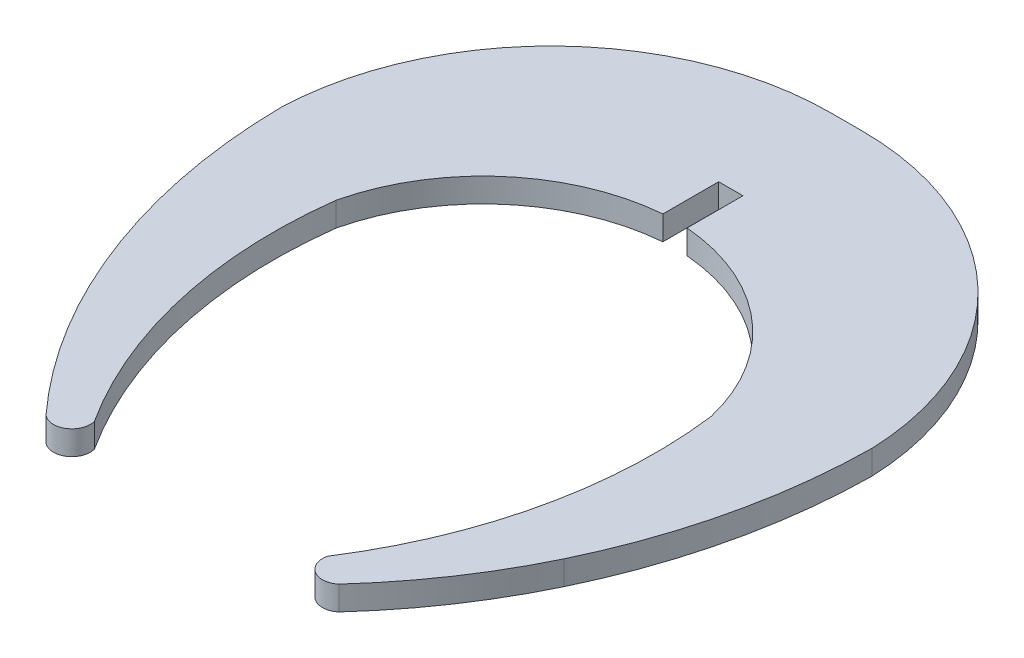
ISO-10303-21;
HEADER;
FILE_DESCRIPTION(('STEP AP214'),'2;1');
FILE_NAME('part.step','',(''),(''),'','','');
FILE_SCHEMA(('AUTOMOTIVE_DESIGN { 1 0 10303 214 1 1 1 1 }'));
ENDSEC;
DATA;
#1=APPLICATION_CONTEXT('core data for automotive mechanical design processes');
#2=APPLICATION_PROTOCOL_DEFINITION('international standard','automotive_design',2000,#1);
#3=PRODUCT_CONTEXT('',#1,'mechanical');
#4=PRODUCT('Part','Part','',(#3));
#5=PRODUCT_RELATED_PRODUCT_CATEGORY('part','',(#4));
#6=PRODUCT_DEFINITION_FORMATION('','',#4);
#7=PRODUCT_DEFINITION_CONTEXT('part definition',#1,'design');
#8=PRODUCT_DEFINITION('design','',#6,#7);
#9=PRODUCT_DEFINITION_SHAPE('','',#8);
#10=(LENGTH_UNIT() NAMED_UNIT(*) SI_UNIT(.MILLI.,.METRE.));
#11=(NAMED_UNIT(*) PLANE_ANGLE_UNIT() SI_UNIT($,.RADIAN.));
#12=(NAMED_UNIT(*) SI_UNIT($,.STERADIAN.) SOLID_ANGLE_UNIT());
#13=UNCERTAINTY_MEASURE_WITH_UNIT(LENGTH_MEASURE(1.E-05),#10,'distance_accuracy_value','');
#14=(GEOMETRIC_REPRESENTATION_CONTEXT(3) GLOBAL_UNCERTAINTY_ASSIGNED_CONTEXT((#13)) GLOBAL_UNIT_ASSIGNED_CONTEXT((#10,
#11,#12)) REPRESENTATION_CONTEXT('',''));
#15=CARTESIAN_POINT('',(0.,0.,0.));
#16=DIRECTION('',(0.,0.,1.));
#17=DIRECTION('',(1.,0.,0.));
#18=AXIS2_PLACEMENT_3D('',#15,#16,#17);
#19=CARTESIAN_POINT('',(164.81900314015,1.45,-291.24130125598));
#20=DIRECTION('',(0.,-1.,0.));
#21=DIRECTION('',(0.,0.,-1.));
#22=AXIS2_PLACEMENT_3D('',#19,#20,#21);
#23=CYLINDRICAL_SURFACE('',#22,28.125270990971);
#24=CARTESIAN_POINT('',(164.81900314015,0.,-291.24130125598));
#25=DIRECTION('',(0.,1.,0.));
#26=DIRECTION('',(0.,0.,1.));
#27=AXIS2_PLACEMENT_3D('',#24,#25,#26);
#28=CIRCLE('',#27,28.125270990971);
#29=CARTESIAN_POINT('',(188.476639673771,0.,-276.031202572584));
#30=VERTEX_POINT('',#29);
#31=CARTESIAN_POINT('',(192.718667057805,0.,-294.796525805493));
#32=VERTEX_POINT('',#31);
#33=EDGE_CURVE('E180',#30,#32,#28,.T.);
#34=ORIENTED_EDGE('',*,*,#33,.F.);
#35=DIRECTION('',(0.,-1.,0.));
#36=VECTOR('',#35,1.);
#37=CARTESIAN_POINT('',(188.476639673771,1.45,-276.031202572584));
#38=LINE('',#37,#36);
#39=CARTESIAN_POINT('',(188.476639673771,1.45,-276.031202572584));
#40=VERTEX_POINT('',#39);
#41=EDGE_CURVE('E11',#40,#30,#38,.T.);
#42=ORIENTED_EDGE('',*,*,#41,.F.);
#43=CARTESIAN_POINT('',(164.81900314015,1.45,-291.24130125598));
#44=DIRECTION('',(0.,1.,0.));
#45=DIRECTION('',(0.,0.,1.));
#46=AXIS2_PLACEMENT_3D('',#43,#44,#45);
#47=CIRCLE('',#46,28.125270990971);
#48=CARTESIAN_POINT('',(192.718667057805,1.45,-294.796525805493));
#49=VERTEX_POINT('',#48);
#50=EDGE_CURVE('E217',#40,#49,#47,.T.);
#51=ORIENTED_EDGE('',*,*,#50,.T.);
#52=DIRECTION('',(0.,-1.,0.));
#53=VECTOR('',#52,1.);
#54=CARTESIAN_POINT('',(192.718667057805,1.45,-294.796525805493));
#55=LINE('',#54,#53);
#56=EDGE_CURVE('E53',#49,#32,#55,.T.);
#57=ORIENTED_EDGE('',*,*,#56,.T.);
#58=EDGE_LOOP('',(#34,#42,#51,#57));
#59=FACE_BOUND('',#58,.T.);
#60=ADVANCED_FACE('F37',(#59),#23,.F.);
#61=CARTESIAN_POINT('',(189.540988425837,1.45,-275.743940180891));
#62=DIRECTION('',(0.,-1.,0.));
#63=DIRECTION('',(0.,0.,-1.));
#64=AXIS2_PLACEMENT_3D('',#61,#62,#63);
#65=CYLINDRICAL_SURFACE('',#64,1.10243274067267);
#66=CARTESIAN_POINT('',(189.540988425837,0.,-275.743940180891));
#67=DIRECTION('',(0.,1.,0.));
#68=DIRECTION('',(0.,0.,1.));
#69=AXIS2_PLACEMENT_3D('',#66,#67,#68);
#70=CIRCLE('',#69,1.10243274067267);
#71=CARTESIAN_POINT('',(190.262797367854,0.,-274.9106636368));
#72=VERTEX_POINT('',#71);
#73=EDGE_CURVE('E182',#30,#72,#70,.T.);
#74=ORIENTED_EDGE('',*,*,#73,.T.);
#75=DIRECTION('',(0.,-1.,0.));
#76=VECTOR('',#75,1.);
#77=CARTESIAN_POINT('',(190.262797367854,1.45,-274.9106636368));
#78=LINE('',#77,#76);
#79=CARTESIAN_POINT('',(190.262797367854,1.45,-274.9106636368));
#80=VERTEX_POINT('',#79);
#81=EDGE_CURVE('E45',#80,#72,#78,.T.);
#82=ORIENTED_EDGE('',*,*,#81,.F.);
#83=CARTESIAN_POINT('',(189.540988425837,1.45,-275.743940180891));
#84=DIRECTION('',(0.,1.,0.));
#85=DIRECTION('',(0.,0.,1.));
#86=AXIS2_PLACEMENT_3D('',#83,#84,#85);
#87=CIRCLE('',#86,1.10243274067267);
#88=EDGE_CURVE('E467',#40,#80,#87,.T.);
#89=ORIENTED_EDGE('',*,*,#88,.F.);
#90=ORIENTED_EDGE('',*,*,#41,.T.);
#91=EDGE_LOOP('',(#74,#82,#89,#90));
#92=FACE_BOUND('',#91,.T.);
#93=ADVANCED_FACE('F312',(#92),#65,.T.);
#94=CARTESIAN_POINT('',(165.404822420396,1.45,-297.533530419202));
#95=DIRECTION('',(0.,-1.,0.));
#96=DIRECTION('',(0.,0.,-1.));
#97=AXIS2_PLACEMENT_3D('',#94,#95,#96);
#98=CYLINDRICAL_SURFACE('',#97,33.611203785981);
#99=CARTESIAN_POINT('',(165.404822420396,0.,-297.533530419202));
#100=DIRECTION('',(0.,1.,0.));
#101=DIRECTION('',(0.,0.,1.));
#102=AXIS2_PLACEMENT_3D('',#99,#100,#101);
#103=CIRCLE('',#102,33.611203785981);
#104=CARTESIAN_POINT('',(195.707854724813,0.,-282.992579518376));
#105=VERTEX_POINT('',#104);
#106=EDGE_CURVE('E184',#72,#105,#103,.T.);
#107=ORIENTED_EDGE('',*,*,#106,.T.);
#108=DIRECTION('',(0.,-1.,0.));
#109=VECTOR('',#108,1.);
#110=CARTESIAN_POINT('',(195.707854724813,1.45,-282.992579518376));
#111=LINE('',#110,#109);
#112=CARTESIAN_POINT('',(195.707854724813,1.45,-282.992579518376));
#113=VERTEX_POINT('',#112);
#114=EDGE_CURVE('E243',#113,#105,#111,.T.);
#115=ORIENTED_EDGE('',*,*,#114,.F.);
#116=CARTESIAN_POINT('',(165.404822420396,1.45,-297.533530419202));
#117=DIRECTION('',(0.,1.,0.));
#118=DIRECTION('',(0.,0.,1.));
#119=AXIS2_PLACEMENT_3D('',#116,#117,#118);
#120=CIRCLE('',#119,33.611203785981);
#121=EDGE_CURVE('E252',#80,#113,#120,.T.);
#122=ORIENTED_EDGE('',*,*,#121,.F.);
#123=ORIENTED_EDGE('',*,*,#81,.T.);
#124=EDGE_LOOP('',(#107,#115,#122,#123));
#125=FACE_BOUND('',#124,.T.);
#126=ADVANCED_FACE('F250',(#125),#98,.T.);
#127=CARTESIAN_POINT('',(163.664056085918,1.45,-298.368839395134));
#128=DIRECTION('',(0.,-1.,0.));
#129=DIRECTION('',(0.,0.,-1.));
#130=AXIS2_PLACEMENT_3D('',#127,#128,#129);
#131=CYLINDRICAL_SURFACE('',#130,35.5420089332);
#132=CARTESIAN_POINT('',(163.664056085918,0.,-298.368839395134));
#133=DIRECTION('',(0.,1.,0.));
#134=DIRECTION('',(0.,0.,1.));
#135=AXIS2_PLACEMENT_3D('',#132,#133,#134);
#136=CIRCLE('',#135,35.5420089332);
#137=CARTESIAN_POINT('',(199.203888548825,0.,-297.975510631665));
#138=VERTEX_POINT('',#137);
#139=EDGE_CURVE('E186',#105,#138,#136,.T.);
#140=ORIENTED_EDGE('',*,*,#139,.T.);
#141=DIRECTION('',(0.,-1.,0.));
#142=VECTOR('',#141,1.);
#143=CARTESIAN_POINT('',(199.203888548825,1.45,-297.975510631665));
#144=LINE('',#143,#142);
#145=CARTESIAN_POINT('',(199.203888548825,1.45,-297.975510631665));
#146=VERTEX_POINT('',#145);
#147=EDGE_CURVE('E240',#146,#138,#144,.T.);
#148=ORIENTED_EDGE('',*,*,#147,.F.);
#149=CARTESIAN_POINT('',(163.664056085918,1.45,-298.368839395134));
#150=DIRECTION('',(0.,1.,0.));
#151=DIRECTION('',(0.,0.,1.));
#152=AXIS2_PLACEMENT_3D('',#149,#150,#151);
#153=CIRCLE('',#152,35.5420089332);
#154=EDGE_CURVE('E271',#113,#146,#153,.T.);
#155=ORIENTED_EDGE('',*,*,#154,.F.);
#156=ORIENTED_EDGE('',*,*,#114,.T.);
#157=EDGE_LOOP('',(#140,#148,#155,#156));
#158=FACE_BOUND('',#157,.T.);
#159=ADVANCED_FACE('F261',(#158),#131,.T.);
#160=CARTESIAN_POINT('',(182.396440485219,1.45,-297.37433335078));
#161=DIRECTION('',(0.,-1.,0.));
#162=DIRECTION('',(0.,0.,-1.));
#163=AXIS2_PLACEMENT_3D('',#160,#161,#162);
#164=CYLINDRICAL_SURFACE('',#163,16.818196233064);
#165=CARTESIAN_POINT('',(182.396440485219,0.,-297.37433335078));
#166=DIRECTION('',(0.,1.,0.));
#167=DIRECTION('',(0.,0.,1.));
#168=AXIS2_PLACEMENT_3D('',#165,#166,#167);
#169=CIRCLE('',#168,16.818196233064);
#170=CARTESIAN_POINT('',(182.39644062977,0.,-314.192529583844));
#171=VERTEX_POINT('',#170);
#172=EDGE_CURVE('E188',#138,#171,#169,.T.);
#173=ORIENTED_EDGE('',*,*,#172,.T.);
#174=DIRECTION('',(0.,-1.,0.));
#175=VECTOR('',#174,1.);
#176=CARTESIAN_POINT('',(182.39644062977,1.45,-314.192529583844));
#177=LINE('',#176,#175);
#178=CARTESIAN_POINT('',(182.39644062977,1.45,-314.192529583844));
#179=VERTEX_POINT('',#178);
#180=EDGE_CURVE('E238',#179,#171,#177,.T.);
#181=ORIENTED_EDGE('',*,*,#180,.F.);
#182=CARTESIAN_POINT('',(182.396440485219,1.45,-297.37433335078));
#183=DIRECTION('',(0.,1.,0.));
#184=DIRECTION('',(0.,0.,1.));
#185=AXIS2_PLACEMENT_3D('',#182,#183,#184);
#186=CIRCLE('',#185,16.818196233064);
#187=EDGE_CURVE('E267',#146,#179,#186,.T.);
#188=ORIENTED_EDGE('',*,*,#187,.F.);
#189=ORIENTED_EDGE('',*,*,#147,.T.);
#190=EDGE_LOOP('',(#173,#181,#188,#189));
#191=FACE_BOUND('',#190,.T.);
#192=ADVANCED_FACE('F265',(#191),#164,.T.);
#193=CARTESIAN_POINT('',(-48.3605533165496,1.45,-314.192559632692));
#194=DIRECTION('',(1.30218581236673E-07,0.,-0.999999999999991));
#195=DIRECTION('',(-0.999999999999992,0.,-1.30218581236673E-07));
#196=AXIS2_PLACEMENT_3D('',#193,#194,#195);
#197=PLANE('',#196);
#198=DIRECTION('',(0.999999999999992,0.,1.30218581236673E-07));
#199=VECTOR('',#198,1.);
#200=CARTESIAN_POINT('',(-48.3605533165496,0.,-314.192559632692));
#201=LINE('',#200,#199);
#202=CARTESIAN_POINT('',(180.53034742943,0.,-314.192529826844));
#203=VERTEX_POINT('',#202);
#204=EDGE_CURVE('E191',#203,#171,#201,.T.);
#205=ORIENTED_EDGE('',*,*,#204,.F.);
#206=DIRECTION('',(0.,-1.,0.));
#207=VECTOR('',#206,1.);
#208=CARTESIAN_POINT('',(180.53034742943,1.45,-314.192529826844));
#209=LINE('',#208,#207);
#210=CARTESIAN_POINT('',(180.53034742943,1.45,-314.192529826844));
#211=VERTEX_POINT('',#210);
#212=EDGE_CURVE('E236',#211,#203,#209,.T.);
#213=ORIENTED_EDGE('',*,*,#212,.F.);
#214=DIRECTION('',(0.999999999999992,0.,1.30218581236673E-07));
#215=VECTOR('',#214,1.);
#216=CARTESIAN_POINT('',(-48.3605533165496,1.45,-314.192559632692));
#217=LINE('',#216,#215);
#218=EDGE_CURVE('E270',#211,#179,#217,.T.);
#219=ORIENTED_EDGE('',*,*,#218,.T.);
#220=ORIENTED_EDGE('',*,*,#180,.T.);
#221=EDGE_LOOP('',(#205,#213,#219,#220));
#222=FACE_BOUND('',#221,.T.);
#223=ADVANCED_FACE('F411',(#222),#197,.T.);
#224=CARTESIAN_POINT('',(180.53034742943,1.45,-297.37433335078));
#225=DIRECTION('',(0.,-1.,0.));
#226=DIRECTION('',(0.,0.,-1.));
#227=AXIS2_PLACEMENT_3D('',#224,#225,#226);
#228=CYLINDRICAL_SURFACE('',#227,16.818196476064);
#229=CARTESIAN_POINT('',(180.53034742943,0.,-297.37433335078));
#230=DIRECTION('',(0.,1.,0.));
#231=DIRECTION('',(0.,0.,1.));
#232=AXIS2_PLACEMENT_3D('',#229,#230,#231);
#233=CIRCLE('',#232,16.818196476064);
#234=CARTESIAN_POINT('',(163.722899070199,0.,-297.975509164713));
#235=VERTEX_POINT('',#234);
#236=EDGE_CURVE('E194',#203,#235,#233,.T.);
#237=ORIENTED_EDGE('',*,*,#236,.T.);
#238=DIRECTION('',(0.,-1.,0.));
#239=VECTOR('',#238,1.);
#240=CARTESIAN_POINT('',(163.722899070199,1.45,-297.975509164713));
#241=LINE('',#240,#239);
#242=CARTESIAN_POINT('',(163.722899070199,1.45,-297.975509164713));
#243=VERTEX_POINT('',#242);
#244=EDGE_CURVE('E233',#243,#235,#241,.T.);
#245=ORIENTED_EDGE('',*,*,#244,.F.);
#246=CARTESIAN_POINT('',(180.53034742943,1.45,-297.37433335078));
#247=DIRECTION('',(0.,1.,0.));
#248=DIRECTION('',(0.,0.,1.));
#249=AXIS2_PLACEMENT_3D('',#246,#247,#248);
#250=CIRCLE('',#249,16.818196476064);
#251=EDGE_CURVE('E273',#211,#243,#250,.T.);
#252=ORIENTED_EDGE('',*,*,#251,.F.);
#253=ORIENTED_EDGE('',*,*,#212,.T.);
#254=EDGE_LOOP('',(#237,#245,#252,#253));
#255=FACE_BOUND('',#254,.T.);
#256=ADVANCED_FACE('F401',(#255),#228,.T.);
#257=CARTESIAN_POINT('',(199.26273198907,1.45,-298.368840644731));
#258=DIRECTION('',(0.,-1.,0.));
#259=DIRECTION('',(0.,0.,-1.));
#260=AXIS2_PLACEMENT_3D('',#257,#258,#259);
#261=CYLINDRICAL_SURFACE('',#260,35.5420094192);
#262=CARTESIAN_POINT('',(199.26273198907,0.,-298.368840644731));
#263=DIRECTION('',(0.,1.,0.));
#264=DIRECTION('',(0.,0.,1.));
#265=AXIS2_PLACEMENT_3D('',#262,#263,#264);
#266=CIRCLE('',#265,35.5420094192);
#267=CARTESIAN_POINT('',(167.21893204676,0.,-282.99258236088));
#268=VERTEX_POINT('',#267);
#269=EDGE_CURVE('E196',#235,#268,#266,.T.);
#270=ORIENTED_EDGE('',*,*,#269,.T.);
#271=DIRECTION('',(0.,-1.,0.));
#272=VECTOR('',#271,1.);
#273=CARTESIAN_POINT('',(167.21893204676,1.45,-282.99258236088));
#274=LINE('',#273,#272);
#275=CARTESIAN_POINT('',(167.21893204676,1.45,-282.99258236088));
#276=VERTEX_POINT('',#275);
#277=EDGE_CURVE('E230',#276,#268,#274,.T.);
#278=ORIENTED_EDGE('',*,*,#277,.F.);
#279=CARTESIAN_POINT('',(199.26273198907,1.45,-298.368840644731));
#280=DIRECTION('',(0.,1.,0.));
#281=DIRECTION('',(0.,0.,1.));
#282=AXIS2_PLACEMENT_3D('',#279,#280,#281);
#283=CIRCLE('',#282,35.5420094192);
#284=EDGE_CURVE('E279',#243,#276,#283,.T.);
#285=ORIENTED_EDGE('',*,*,#284,.F.);
#286=ORIENTED_EDGE('',*,*,#244,.T.);
#287=EDGE_LOOP('',(#270,#278,#285,#286));
#288=FACE_BOUND('',#287,.T.);
#289=ADVANCED_FACE('F391',(#288),#261,.T.);
#290=CARTESIAN_POINT('',(197.52196502154,1.45,-297.533531302992));
#291=DIRECTION('',(0.,-1.,0.));
#292=DIRECTION('',(0.,0.,-1.));
#293=AXIS2_PLACEMENT_3D('',#290,#291,#292);
#294=CYLINDRICAL_SURFACE('',#293,33.611203542981);
#295=CARTESIAN_POINT('',(197.52196502154,0.,-297.533531302992));
#296=DIRECTION('',(0.,1.,0.));
#297=DIRECTION('',(0.,0.,1.));
#298=AXIS2_PLACEMENT_3D('',#295,#296,#297);
#299=CIRCLE('',#298,33.611203542981);
#300=CARTESIAN_POINT('',(172.663989446777,0.,-274.910665570902));
#301=VERTEX_POINT('',#300);
#302=EDGE_CURVE('E198',#268,#301,#299,.T.);
#303=ORIENTED_EDGE('',*,*,#302,.T.);
#304=DIRECTION('',(0.,-1.,0.));
#305=VECTOR('',#304,1.);
#306=CARTESIAN_POINT('',(172.663989446777,1.45,-274.910665570902));
#307=LINE('',#306,#305);
#308=CARTESIAN_POINT('',(172.663989446777,1.45,-274.910665570902));
#309=VERTEX_POINT('',#308);
#310=EDGE_CURVE('E227',#309,#301,#307,.T.);
#311=ORIENTED_EDGE('',*,*,#310,.F.);
#312=CARTESIAN_POINT('',(197.52196502154,1.45,-297.533531302992));
#313=DIRECTION('',(0.,1.,0.));
#314=DIRECTION('',(0.,0.,1.));
#315=AXIS2_PLACEMENT_3D('',#312,#313,#314);
#316=CIRCLE('',#315,33.611203542981);
#317=EDGE_CURVE('E281',#276,#309,#316,.T.);
#318=ORIENTED_EDGE('',*,*,#317,.F.);
#319=ORIENTED_EDGE('',*,*,#277,.T.);
#320=EDGE_LOOP('',(#303,#311,#318,#319));
#321=FACE_BOUND('',#320,.T.);
#322=ADVANCED_FACE('F381',(#321),#294,.T.);
#323=CARTESIAN_POINT('',(173.385799627681,1.45,-275.743941463555));
#324=DIRECTION('',(0.,-1.,0.));
#325=DIRECTION('',(0.,0.,-1.));
#326=AXIS2_PLACEMENT_3D('',#323,#324,#325);
#327=CYLINDRICAL_SURFACE('',#326,1.10243305943426);
#328=CARTESIAN_POINT('',(173.385799627681,0.,-275.743941463555));
#329=DIRECTION('',(0.,1.,0.));
#330=DIRECTION('',(0.,0.,1.));
#331=AXIS2_PLACEMENT_3D('',#328,#329,#330);
#332=CIRCLE('',#331,1.10243305943426);
#333=CARTESIAN_POINT('',(174.450149538204,0.,-276.031200786297));
#334=VERTEX_POINT('',#333);
#335=EDGE_CURVE('E200',#301,#334,#332,.T.);
#336=ORIENTED_EDGE('',*,*,#335,.T.);
#337=DIRECTION('',(0.,-1.,0.));
#338=VECTOR('',#337,1.);
#339=CARTESIAN_POINT('',(174.450149538204,1.45,-276.031200786297));
#340=LINE('',#339,#338);
#341=CARTESIAN_POINT('',(174.450149538204,1.45,-276.031200786297));
#342=VERTEX_POINT('',#341);
#343=EDGE_CURVE('E225',#342,#334,#340,.T.);
#344=ORIENTED_EDGE('',*,*,#343,.F.);
#345=CARTESIAN_POINT('',(173.385799627681,1.45,-275.743941463555));
#346=DIRECTION('',(0.,1.,0.));
#347=DIRECTION('',(0.,0.,1.));
#348=AXIS2_PLACEMENT_3D('',#345,#346,#347);
#349=CIRCLE('',#348,1.10243305943426);
#350=EDGE_CURVE('E283',#309,#342,#349,.T.);
#351=ORIENTED_EDGE('',*,*,#350,.F.);
#352=ORIENTED_EDGE('',*,*,#310,.T.);
#353=EDGE_LOOP('',(#336,#344,#351,#352));
#354=FACE_BOUND('',#353,.T.);
#355=ADVANCED_FACE('F372',(#354),#327,.T.);
#356=CARTESIAN_POINT('',(198.107784746218,1.45,-291.241301531529));
#357=DIRECTION('',(0.,-1.,0.));
#358=DIRECTION('',(0.,0.,-1.));
#359=AXIS2_PLACEMENT_3D('',#356,#357,#358);
#360=CYLINDRICAL_SURFACE('',#359,28.125270990971);
#361=CARTESIAN_POINT('',(198.107784746218,0.,-291.241301531529));
#362=DIRECTION('',(0.,1.,0.));
#363=DIRECTION('',(0.,0.,1.));
#364=AXIS2_PLACEMENT_3D('',#361,#362,#363);
#365=CIRCLE('',#364,28.125270990971);
#366=CARTESIAN_POINT('',(170.208120698498,0.,-294.796525060358));
#367=VERTEX_POINT('',#366);
#368=EDGE_CURVE('E203',#367,#334,#365,.T.);
#369=ORIENTED_EDGE('',*,*,#368,.F.);
#370=DIRECTION('',(0.,-1.,0.));
#371=VECTOR('',#370,1.);
#372=CARTESIAN_POINT('',(170.208120698498,1.45,-294.796525060358));
#373=LINE('',#372,#371);
#374=CARTESIAN_POINT('',(170.208120698498,1.45,-294.796525060358));
#375=VERTEX_POINT('',#374);
#376=EDGE_CURVE('E223',#375,#367,#373,.T.);
#377=ORIENTED_EDGE('',*,*,#376,.F.);
#378=CARTESIAN_POINT('',(198.107784746218,1.45,-291.241301531529));
#379=DIRECTION('',(0.,1.,0.));
#380=DIRECTION('',(0.,0.,1.));
#381=AXIS2_PLACEMENT_3D('',#378,#379,#380);
#382=CIRCLE('',#381,28.125270990971);
#383=EDGE_CURVE('E285',#375,#342,#382,.T.);
#384=ORIENTED_EDGE('',*,*,#383,.T.);
#385=ORIENTED_EDGE('',*,*,#343,.T.);
#386=EDGE_LOOP('',(#369,#377,#384,#385));
#387=FACE_BOUND('',#386,.T.);
#388=ADVANCED_FACE('F298',(#387),#360,.F.);
#389=CARTESIAN_POINT('',(181.739920034534,1.45,-292.084685769131));
#390=DIRECTION('',(0.,-1.,0.));
#391=DIRECTION('',(0.,0.,-1.));
#392=AXIS2_PLACEMENT_3D('',#389,#390,#391);
#393=CYLINDRICAL_SURFACE('',#392,11.846369412948);
#394=CARTESIAN_POINT('',(181.739920034534,0.,-292.084685769131));
#395=DIRECTION('',(0.,1.,0.));
#396=DIRECTION('',(0.,0.,1.));
#397=AXIS2_PLACEMENT_3D('',#394,#395,#396);
#398=CIRCLE('',#397,11.846369412948);
#399=CARTESIAN_POINT('',(180.734392460618,0.,-303.888303120017));
#400=VERTEX_POINT('',#399);
#401=EDGE_CURVE('E206',#400,#367,#398,.T.);
#402=ORIENTED_EDGE('',*,*,#401,.F.);
#403=DIRECTION('',(0.,-1.,0.));
#404=VECTOR('',#403,1.);
#405=CARTESIAN_POINT('',(180.734392460618,1.45,-303.888303120017));
#406=LINE('',#405,#404);
#407=CARTESIAN_POINT('',(180.734392460618,1.45,-303.888303120017));
#408=VERTEX_POINT('',#407);
#409=EDGE_CURVE('E221',#408,#400,#406,.T.);
#410=ORIENTED_EDGE('',*,*,#409,.F.);
#411=CARTESIAN_POINT('',(181.739920034534,1.45,-292.084685769131));
#412=DIRECTION('',(0.,1.,0.));
#413=DIRECTION('',(0.,0.,1.));
#414=AXIS2_PLACEMENT_3D('',#411,#412,#413);
#415=CIRCLE('',#414,11.846369412948);
#416=EDGE_CURVE('E288',#408,#375,#415,.T.);
#417=ORIENTED_EDGE('',*,*,#416,.T.);
#418=ORIENTED_EDGE('',*,*,#376,.T.);
#419=EDGE_LOOP('',(#402,#410,#417,#418));
#420=FACE_BOUND('',#419,.T.);
#421=ADVANCED_FACE('F292',(#420),#393,.F.);
#422=CARTESIAN_POINT('',(180.734385045591,1.45,-266.906624786154));
#423=DIRECTION('',(-0.99999999999998,0.,-2.00505425756201E-07));
#424=DIRECTION('',(-2.00505425756201E-07,0.,0.99999999999998));
#425=AXIS2_PLACEMENT_3D('',#422,#423,#424);
#426=PLANE('',#425);
#427=DIRECTION('',(2.00505425756201E-07,0.,-0.99999999999998));
#428=VECTOR('',#427,1.);
#429=CARTESIAN_POINT('',(180.734385045591,0.,-266.906624786154));
#430=LINE('',#429,#428);
#431=CARTESIAN_POINT('',(180.734393132994,0.,-307.241707050971));
#432=VERTEX_POINT('',#431);
#433=EDGE_CURVE('E209',#400,#432,#430,.T.);
#434=ORIENTED_EDGE('',*,*,#433,.T.);
#435=DIRECTION('',(0.,-1.,0.));
#436=VECTOR('',#435,1.);
#437=CARTESIAN_POINT('',(180.734393132994,1.45,-307.241707050971));
#438=LINE('',#437,#436);
#439=CARTESIAN_POINT('',(180.734393132994,1.45,-307.241707050971));
#440=VERTEX_POINT('',#439);
#441=EDGE_CURVE('E172',#440,#432,#438,.T.);
#442=ORIENTED_EDGE('',*,*,#441,.F.);
#443=DIRECTION('',(2.00505425756201E-07,0.,-0.99999999999998));
#444=VECTOR('',#443,1.);
#445=CARTESIAN_POINT('',(180.734385045591,1.45,-266.906624786154));
#446=LINE('',#445,#444);
#447=EDGE_CURVE('E160',#408,#440,#446,.T.);
#448=ORIENTED_EDGE('',*,*,#447,.F.);
#449=ORIENTED_EDGE('',*,*,#409,.T.);
#450=EDGE_LOOP('',(#434,#442,#448,#449));
#451=FACE_BOUND('',#450,.T.);
#452=ADVANCED_FACE('F302',(#451),#426,.F.);
#453=CARTESIAN_POINT('',(-48.360559474051,1.45,-307.241707050971));
#454=DIRECTION('',(0.,0.,-1.));
#455=DIRECTION('',(-1.,0.,0.));
#456=AXIS2_PLACEMENT_3D('',#453,#454,#455);
#457=PLANE('',#456);
#458=DIRECTION('',(1.,0.,0.));
#459=VECTOR('',#458,1.);
#460=CARTESIAN_POINT('',(-48.360559474051,0.,-307.241707050971));
#461=LINE('',#460,#459);
#462=CARTESIAN_POINT('',(182.19239499466,0.,-307.241707050971));
#463=VERTEX_POINT('',#462);
#464=EDGE_CURVE('E169',#432,#463,#461,.T.);
#465=ORIENTED_EDGE('',*,*,#464,.T.);
#466=DIRECTION('',(0.,-1.,0.));
#467=VECTOR('',#466,1.);
#468=CARTESIAN_POINT('',(182.19239499466,1.45,-307.241707050971));
#469=LINE('',#468,#467);
#470=CARTESIAN_POINT('',(182.19239499466,1.45,-307.241707050971));
#471=VERTEX_POINT('',#470);
#472=EDGE_CURVE('E166',#471,#463,#469,.T.);
#473=ORIENTED_EDGE('',*,*,#472,.F.);
#474=DIRECTION('',(1.,0.,0.));
#475=VECTOR('',#474,1.);
#476=CARTESIAN_POINT('',(-48.360559474051,1.45,-307.241707050971));
#477=LINE('',#476,#475);
#478=EDGE_CURVE('E151',#440,#471,#477,.T.);
#479=ORIENTED_EDGE('',*,*,#478,.F.);
#480=ORIENTED_EDGE('',*,*,#441,.T.);
#481=EDGE_LOOP('',(#465,#473,#479,#480));
#482=FACE_BOUND('',#481,.T.);
#483=ADVANCED_FACE('F167',(#482),#457,.F.);
#484=CARTESIAN_POINT('',(182.1923906924,1.45,-266.906646129458));
#485=DIRECTION('',(-0.999999999999994,0.,-1.06663029680352E-07));
#486=DIRECTION('',(-1.06663029680352E-07,0.,0.999999999999994));
#487=AXIS2_PLACEMENT_3D('',#484,#485,#486);
#488=PLANE('',#487);
#489=DIRECTION('',(1.06663029680352E-07,0.,-0.999999999999994));
#490=VECTOR('',#489,1.);
#491=CARTESIAN_POINT('',(182.1923906924,0.,-266.906646129458));
#492=LINE('',#491,#490);
#493=CARTESIAN_POINT('',(182.192394636976,0.,-303.888302929534));
#494=VERTEX_POINT('',#493);
#495=EDGE_CURVE('E212',#494,#463,#492,.T.);
#496=ORIENTED_EDGE('',*,*,#495,.F.);
#497=DIRECTION('',(0.,-1.,0.));
#498=VECTOR('',#497,1.);
#499=CARTESIAN_POINT('',(182.192394636976,1.45,-303.888302929534));
#500=LINE('',#499,#498);
#501=CARTESIAN_POINT('',(182.192394636976,1.45,-303.888302929534));
#502=VERTEX_POINT('',#501);
#503=EDGE_CURVE('E102',#502,#494,#500,.T.);
#504=ORIENTED_EDGE('',*,*,#503,.F.);
#505=DIRECTION('',(1.06663029680352E-07,0.,-0.999999999999994));
#506=VECTOR('',#505,1.);
#507=CARTESIAN_POINT('',(182.1923906924,1.45,-266.906646129458));
#508=LINE('',#507,#506);
#509=EDGE_CURVE('E157',#502,#471,#508,.T.);
#510=ORIENTED_EDGE('',*,*,#509,.T.);
#511=ORIENTED_EDGE('',*,*,#472,.T.);
#512=EDGE_LOOP('',(#496,#504,#510,#511));
#513=FACE_BOUND('',#512,.T.);
#514=ADVANCED_FACE('F174',(#513),#488,.T.);
#515=CARTESIAN_POINT('',(181.186867959754,1.45,-292.084685502261));
#516=DIRECTION('',(0.,-1.,0.));
#517=DIRECTION('',(0.,0.,-1.));
#518=AXIS2_PLACEMENT_3D('',#515,#516,#517);
#519=CYLINDRICAL_SURFACE('',#518,11.846369412948);
#520=CARTESIAN_POINT('',(181.186867959754,0.,-292.084685502261));
#521=DIRECTION('',(0.,1.,0.));
#522=DIRECTION('',(0.,0.,1.));
#523=AXIS2_PLACEMENT_3D('',#520,#521,#522);
#524=CIRCLE('',#523,11.846369412948);
#525=EDGE_CURVE('E214',#32,#494,#524,.T.);
#526=ORIENTED_EDGE('',*,*,#525,.F.);
#527=ORIENTED_EDGE('',*,*,#56,.F.);
#528=CARTESIAN_POINT('',(181.186867959754,1.45,-292.084685502261));
#529=DIRECTION('',(0.,1.,0.));
#530=DIRECTION('',(0.,0.,1.));
#531=AXIS2_PLACEMENT_3D('',#528,#529,#530);
#532=CIRCLE('',#531,11.846369412948);
#533=EDGE_CURVE('E175',#49,#502,#532,.T.);
#534=ORIENTED_EDGE('',*,*,#533,.T.);
#535=ORIENTED_EDGE('',*,*,#503,.T.);
#536=EDGE_LOOP('',(#526,#527,#534,#535));
#537=FACE_BOUND('',#536,.T.);
#538=ADVANCED_FACE('F316',(#537),#519,.F.);
#539=CARTESIAN_POINT('',(-48.360559474051,1.45,-266.906670720934));
#540=DIRECTION('',(0.,1.,0.));
#541=DIRECTION('',(0.,0.,1.));
#542=AXIS2_PLACEMENT_3D('',#539,#540,#541);
#543=PLANE('',#542);
#544=ORIENTED_EDGE('',*,*,#50,.F.);
#545=ORIENTED_EDGE('',*,*,#88,.T.);
#546=ORIENTED_EDGE('',*,*,#121,.T.);
#547=ORIENTED_EDGE('',*,*,#154,.T.);
#548=ORIENTED_EDGE('',*,*,#187,.T.);
#549=ORIENTED_EDGE('',*,*,#218,.F.);
#550=ORIENTED_EDGE('',*,*,#251,.T.);
#551=ORIENTED_EDGE('',*,*,#284,.T.);
#552=ORIENTED_EDGE('',*,*,#317,.T.);
#553=ORIENTED_EDGE('',*,*,#350,.T.);
#554=ORIENTED_EDGE('',*,*,#383,.F.);
#555=ORIENTED_EDGE('',*,*,#416,.F.);
#556=ORIENTED_EDGE('',*,*,#447,.T.);
#557=ORIENTED_EDGE('',*,*,#478,.T.);
#558=ORIENTED_EDGE('',*,*,#509,.F.);
#559=ORIENTED_EDGE('',*,*,#533,.F.);
#560=EDGE_LOOP('',(#544,#545,#546,#547,#548,#549,#550,#551,#552,#553,#554,#555,#556,#557,#558,#559));
#561=FACE_BOUND('',#560,.T.);
#562=ADVANCED_FACE('F154',(#561),#543,.T.);
#563=CARTESIAN_POINT('',(-48.360559474051,0.,-266.906670720934));
#564=DIRECTION('',(0.,1.,0.));
#565=DIRECTION('',(0.,0.,1.));
#566=AXIS2_PLACEMENT_3D('',#563,#564,#565);
#567=PLANE('',#566);
#568=ORIENTED_EDGE('',*,*,#33,.T.);
#569=ORIENTED_EDGE('',*,*,#525,.T.);
#570=ORIENTED_EDGE('',*,*,#495,.T.);
#571=ORIENTED_EDGE('',*,*,#464,.F.);
#572=ORIENTED_EDGE('',*,*,#433,.F.);
#573=ORIENTED_EDGE('',*,*,#401,.T.);
#574=ORIENTED_EDGE('',*,*,#368,.T.);
#575=ORIENTED_EDGE('',*,*,#335,.F.);
#576=ORIENTED_EDGE('',*,*,#302,.F.);
#577=ORIENTED_EDGE('',*,*,#269,.F.);
#578=ORIENTED_EDGE('',*,*,#236,.F.);
#579=ORIENTED_EDGE('',*,*,#204,.T.);
#580=ORIENTED_EDGE('',*,*,#172,.F.);
#581=ORIENTED_EDGE('',*,*,#139,.F.);
#582=ORIENTED_EDGE('',*,*,#106,.F.);
#583=ORIENTED_EDGE('',*,*,#73,.F.);
#584=EDGE_LOOP('',(#568,#569,#570,#571,#572,#573,#574,#575,#576,#577,#578,#579,#580,#581,#582,#583));
#585=FACE_BOUND('',#584,.T.);
#586=ADVANCED_FACE('F257',(#585),#567,.F.);
#587=CLOSED_SHELL('',(#60,#93,#126,#159,#192,#223,#256,#289,#322,#355,#388,#421,#452,#483,#514,
#538,#562,#586));
#588=MANIFOLD_SOLID_BREP('B2',#587);
#589=ADVANCED_BREP_SHAPE_REPRESENTATION('',(#18,#588),#14);
#590=SHAPE_DEFINITION_REPRESENTATION(#9,#589);
ENDSEC;
END-ISO-10303-21;
